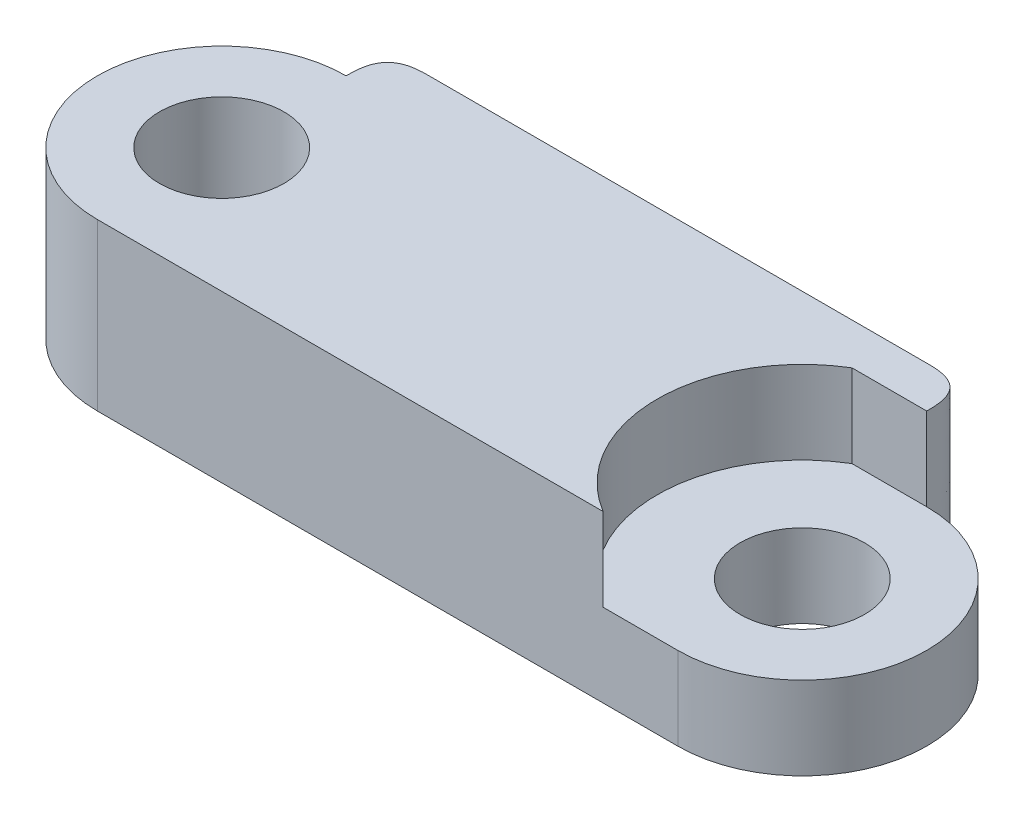
ISO-10303-21;
HEADER;
FILE_DESCRIPTION(('STEP AP214'),'2;1');
FILE_NAME('part.step','',(''),(''),'','','');
FILE_SCHEMA(('AUTOMOTIVE_DESIGN { 1 0 10303 214 1 1 1 1 }'));
ENDSEC;
DATA;
#1=APPLICATION_CONTEXT('core data for automotive mechanical design processes');
#2=APPLICATION_PROTOCOL_DEFINITION('international standard','automotive_design',2000,#1);
#3=PRODUCT_CONTEXT('',#1,'mechanical');
#4=PRODUCT('Part','Part','',(#3));
#5=PRODUCT_RELATED_PRODUCT_CATEGORY('part','',(#4));
#6=PRODUCT_DEFINITION_FORMATION('','',#4);
#7=PRODUCT_DEFINITION_CONTEXT('part definition',#1,'design');
#8=PRODUCT_DEFINITION('design','',#6,#7);
#9=PRODUCT_DEFINITION_SHAPE('','',#8);
#10=(LENGTH_UNIT() NAMED_UNIT(*) SI_UNIT(.MILLI.,.METRE.));
#11=(NAMED_UNIT(*) PLANE_ANGLE_UNIT() SI_UNIT($,.RADIAN.));
#12=(NAMED_UNIT(*) SI_UNIT($,.STERADIAN.) SOLID_ANGLE_UNIT());
#13=UNCERTAINTY_MEASURE_WITH_UNIT(LENGTH_MEASURE(1.E-05),#10,'distance_accuracy_value','');
#14=(GEOMETRIC_REPRESENTATION_CONTEXT(3) GLOBAL_UNCERTAINTY_ASSIGNED_CONTEXT((#13)) GLOBAL_UNIT_ASSIGNED_CONTEXT((#10,
#11,#12)) REPRESENTATION_CONTEXT('',''));
#15=CARTESIAN_POINT('',(0.,0.,0.));
#16=DIRECTION('',(0.,0.,1.));
#17=DIRECTION('',(1.,0.,0.));
#18=AXIS2_PLACEMENT_3D('',#15,#16,#17);
#19=CARTESIAN_POINT('',(-7.,2.,0.));
#20=DIRECTION('',(0.,1.,0.));
#21=DIRECTION('',(0.,0.,1.));
#22=AXIS2_PLACEMENT_3D('',#19,#20,#21);
#23=PLANE('',#22);
#24=DIRECTION('',(-1.,0.,0.));
#25=VECTOR('',#24,1.);
#26=CARTESIAN_POINT('',(-7.,2.,-3.));
#27=LINE('',#26,#25);
#28=CARTESIAN_POINT('',(7.,2.,-3.));
#29=VERTEX_POINT('',#28);
#30=CARTESIAN_POINT('',(5.19722436226801,2.,-3.));
#31=VERTEX_POINT('',#30);
#32=EDGE_CURVE('E210',#29,#31,#27,.T.);
#33=ORIENTED_EDGE('',*,*,#32,.F.);
#34=CARTESIAN_POINT('',(6.,2.,-4.));
#35=CARTESIAN_POINT('',(6.16819805153395,2.,-4.));
#36=CARTESIAN_POINT('',(6.3363961030679,2.,-4.));
#37=CARTESIAN_POINT('',(6.70710678118655,2.,-3.92830808016392));
#38=CARTESIAN_POINT('',(6.92830808016392,2.,-3.70710678118655));
#39=CARTESIAN_POINT('',(7.,2.,-3.33639610306789));
#40=CARTESIAN_POINT('',(7.,2.,-3.16819805153395));
#41=CARTESIAN_POINT('',(7.,2.,-3.));
#42=B_SPLINE_CURVE_WITH_KNOTS('',5,(#34,#35,#36,#37,#38,#39,#40,#41),.UNSPECIFIED.,.F.,.F.,(6,2,
6),(0.,0.5,1.),.UNSPECIFIED.);
#43=CARTESIAN_POINT('',(6.,2.,-4.));
#44=VERTEX_POINT('',#43);
#45=EDGE_CURVE('E11',#29,#44,#42,.F.);
#46=ORIENTED_EDGE('',*,*,#45,.T.);
#47=DIRECTION('',(1.,0.,0.));
#48=VECTOR('',#47,1.);
#49=CARTESIAN_POINT('',(7.,2.,-4.));
#50=LINE('',#49,#48);
#51=CARTESIAN_POINT('',(-6.,2.,-4.));
#52=VERTEX_POINT('',#51);
#53=EDGE_CURVE('E207',#52,#44,#50,.T.);
#54=ORIENTED_EDGE('',*,*,#53,.F.);
#55=CARTESIAN_POINT('',(-7.,2.,-3.));
#56=CARTESIAN_POINT('',(-7.,2.,-3.16819805153395));
#57=CARTESIAN_POINT('',(-7.,2.,-3.33639610306789));
#58=CARTESIAN_POINT('',(-6.92830808016392,2.,-3.70710678118655));
#59=CARTESIAN_POINT('',(-6.70710678118655,2.,-3.92830808016392));
#60=CARTESIAN_POINT('',(-6.3363961030679,2.,-4.));
#61=CARTESIAN_POINT('',(-6.16819805153395,2.,-4.));
#62=CARTESIAN_POINT('',(-6.,2.,-4.));
#63=B_SPLINE_CURVE_WITH_KNOTS('',5,(#55,#56,#57,#58,#59,#60,#61,#62),.UNSPECIFIED.,.F.,.F.,(6,2,
6),(0.,0.5,1.),.UNSPECIFIED.);
#64=CARTESIAN_POINT('',(-7.,2.,-3.));
#65=VERTEX_POINT('',#64);
#66=EDGE_CURVE('E61',#52,#65,#63,.F.);
#67=ORIENTED_EDGE('',*,*,#66,.T.);
#68=CARTESIAN_POINT('',(-7.,2.,0.));
#69=DIRECTION('',(0.,1.,0.));
#70=DIRECTION('',(0.,0.,1.));
#71=AXIS2_PLACEMENT_3D('',#68,#69,#70);
#72=CIRCLE('',#71,3.);
#73=CARTESIAN_POINT('',(-7.,2.,3.));
#74=VERTEX_POINT('',#73);
#75=EDGE_CURVE('E142',#65,#74,#72,.T.);
#76=ORIENTED_EDGE('',*,*,#75,.T.);
#77=DIRECTION('',(1.,0.,0.));
#78=VECTOR('',#77,1.);
#79=CARTESIAN_POINT('',(-7.,2.,3.));
#80=LINE('',#79,#78);
#81=CARTESIAN_POINT('',(5.19722436226801,2.,3.));
#82=VERTEX_POINT('',#81);
#83=EDGE_CURVE('E264',#74,#82,#80,.T.);
#84=ORIENTED_EDGE('',*,*,#83,.T.);
#85=CARTESIAN_POINT('',(7.,2.,0.));
#86=DIRECTION('',(0.,1.,0.));
#87=DIRECTION('',(0.,0.,-1.));
#88=AXIS2_PLACEMENT_3D('',#85,#86,#87);
#89=CIRCLE('',#88,3.5);
#90=EDGE_CURVE('E236',#31,#82,#89,.T.);
#91=ORIENTED_EDGE('',*,*,#90,.F.);
#92=EDGE_LOOP('',(#33,#46,#54,#67,#76,#84,#91));
#93=FACE_BOUND('',#92,.T.);
#94=CARTESIAN_POINT('',(-7.,2.,0.));
#95=DIRECTION('',(0.,1.,0.));
#96=DIRECTION('',(0.,0.,1.));
#97=AXIS2_PLACEMENT_3D('',#94,#95,#96);
#98=CIRCLE('',#97,1.5);
#99=CARTESIAN_POINT('',(-7.,2.,1.5));
#100=VERTEX_POINT('',#99);
#101=EDGE_CURVE('E256',#100,#100,#98,.T.);
#102=ORIENTED_EDGE('',*,*,#101,.F.);
#103=EDGE_LOOP('',(#102));
#104=FACE_BOUND('',#103,.T.);
#105=ADVANCED_FACE('F45',(#93,#104),#23,.T.);
#106=CARTESIAN_POINT('',(-7.,-2.,0.));
#107=DIRECTION('',(0.,1.,0.));
#108=DIRECTION('',(0.,0.,1.));
#109=AXIS2_PLACEMENT_3D('',#106,#107,#108);
#110=PLANE('',#109);
#111=DIRECTION('',(1.,0.,0.));
#112=VECTOR('',#111,1.);
#113=CARTESIAN_POINT('',(7.,-2.,-4.));
#114=LINE('',#113,#112);
#115=CARTESIAN_POINT('',(-6.,-2.,-4.));
#116=VERTEX_POINT('',#115);
#117=CARTESIAN_POINT('',(6.,-2.,-4.));
#118=VERTEX_POINT('',#117);
#119=EDGE_CURVE('E127',#116,#118,#114,.T.);
#120=ORIENTED_EDGE('',*,*,#119,.T.);
#121=CARTESIAN_POINT('',(7.,-2.,-3.));
#122=CARTESIAN_POINT('',(7.,-2.,-3.16819805153395));
#123=CARTESIAN_POINT('',(7.,-2.,-3.33639610306789));
#124=CARTESIAN_POINT('',(6.92830808016392,-2.,-3.70710678118655));
#125=CARTESIAN_POINT('',(6.70710678118655,-2.,-3.92830808016392));
#126=CARTESIAN_POINT('',(6.3363961030679,-2.,-4.));
#127=CARTESIAN_POINT('',(6.16819805153395,-2.,-4.));
#128=CARTESIAN_POINT('',(6.,-2.,-4.));
#129=B_SPLINE_CURVE_WITH_KNOTS('',5,(#121,#122,#123,#124,#125,#126,#127,#128),.UNSPECIFIED.,.F.,
.F.,(6,2,6),(0.,0.5,1.),.UNSPECIFIED.);
#130=CARTESIAN_POINT('',(7.,-2.,-3.));
#131=VERTEX_POINT('',#130);
#132=EDGE_CURVE('E68',#118,#131,#129,.F.);
#133=ORIENTED_EDGE('',*,*,#132,.T.);
#134=CARTESIAN_POINT('',(7.,-2.,0.));
#135=DIRECTION('',(0.,1.,0.));
#136=DIRECTION('',(0.,0.,1.));
#137=AXIS2_PLACEMENT_3D('',#134,#135,#136);
#138=CIRCLE('',#137,3.);
#139=CARTESIAN_POINT('',(7.,-2.,3.));
#140=VERTEX_POINT('',#139);
#141=EDGE_CURVE('E126',#140,#131,#138,.T.);
#142=ORIENTED_EDGE('',*,*,#141,.F.);
#143=DIRECTION('',(1.,0.,0.));
#144=VECTOR('',#143,1.);
#145=CARTESIAN_POINT('',(-7.,-2.,3.));
#146=LINE('',#145,#144);
#147=CARTESIAN_POINT('',(-7.,-2.,3.));
#148=VERTEX_POINT('',#147);
#149=EDGE_CURVE('E143',#148,#140,#146,.T.);
#150=ORIENTED_EDGE('',*,*,#149,.F.);
#151=CARTESIAN_POINT('',(-7.,-2.,0.));
#152=DIRECTION('',(0.,1.,0.));
#153=DIRECTION('',(0.,0.,1.));
#154=AXIS2_PLACEMENT_3D('',#151,#152,#153);
#155=CIRCLE('',#154,3.);
#156=CARTESIAN_POINT('',(-7.,-2.,-3.));
#157=VERTEX_POINT('',#156);
#158=EDGE_CURVE('E260',#157,#148,#155,.T.);
#159=ORIENTED_EDGE('',*,*,#158,.F.);
#160=CARTESIAN_POINT('',(-6.,-2.,-4.));
#161=CARTESIAN_POINT('',(-6.16819805153395,-2.,-4.));
#162=CARTESIAN_POINT('',(-6.3363961030679,-2.,-4.));
#163=CARTESIAN_POINT('',(-6.70710678118655,-2.,-3.92830808016392));
#164=CARTESIAN_POINT('',(-6.92830808016392,-2.,-3.70710678118655));
#165=CARTESIAN_POINT('',(-7.,-2.,-3.33639610306789));
#166=CARTESIAN_POINT('',(-7.,-2.,-3.16819805153395));
#167=CARTESIAN_POINT('',(-7.,-2.,-3.));
#168=B_SPLINE_CURVE_WITH_KNOTS('',5,(#160,#161,#162,#163,#164,#165,#166,#167),.UNSPECIFIED.,.F.,
.F.,(6,2,6),(0.,0.5,1.),.UNSPECIFIED.);
#169=EDGE_CURVE('E77',#157,#116,#168,.F.);
#170=ORIENTED_EDGE('',*,*,#169,.T.);
#171=EDGE_LOOP('',(#120,#133,#142,#150,#159,#170));
#172=FACE_BOUND('',#171,.T.);
#173=CARTESIAN_POINT('',(-7.,-2.,0.));
#174=DIRECTION('',(0.,1.,0.));
#175=DIRECTION('',(0.,0.,1.));
#176=AXIS2_PLACEMENT_3D('',#173,#174,#175);
#177=CIRCLE('',#176,1.5);
#178=CARTESIAN_POINT('',(-7.,-2.,1.5));
#179=VERTEX_POINT('',#178);
#180=EDGE_CURVE('E255',#179,#179,#177,.T.);
#181=ORIENTED_EDGE('',*,*,#180,.T.);
#182=EDGE_LOOP('',(#181));
#183=FACE_BOUND('',#182,.T.);
#184=CARTESIAN_POINT('',(7.,-2.,0.));
#185=DIRECTION('',(0.,1.,0.));
#186=DIRECTION('',(0.,0.,1.));
#187=AXIS2_PLACEMENT_3D('',#184,#185,#186);
#188=CIRCLE('',#187,1.5);
#189=CARTESIAN_POINT('',(7.,-2.,1.5));
#190=VERTEX_POINT('',#189);
#191=EDGE_CURVE('E251',#190,#190,#188,.T.);
#192=ORIENTED_EDGE('',*,*,#191,.T.);
#193=EDGE_LOOP('',(#192));
#194=FACE_BOUND('',#193,.T.);
#195=ADVANCED_FACE('F124',(#172,#183,#194),#110,.F.);
#196=CARTESIAN_POINT('',(-7.,2.,0.));
#197=DIRECTION('',(0.,-1.,0.));
#198=DIRECTION('',(0.,0.,-1.));
#199=AXIS2_PLACEMENT_3D('',#196,#197,#198);
#200=CYLINDRICAL_SURFACE('',#199,3.);
#201=ORIENTED_EDGE('',*,*,#158,.T.);
#202=DIRECTION('',(0.,-1.,0.));
#203=VECTOR('',#202,1.);
#204=CARTESIAN_POINT('',(-7.,2.,3.));
#205=LINE('',#204,#203);
#206=EDGE_CURVE('E271',#74,#148,#205,.T.);
#207=ORIENTED_EDGE('',*,*,#206,.F.);
#208=ORIENTED_EDGE('',*,*,#75,.F.);
#209=CARTESIAN_POINT('',(-7.,-2.2,-3.));
#210=CARTESIAN_POINT('',(-7.,-0.733333333333336,-3.));
#211=CARTESIAN_POINT('',(-7.,0.733333333333336,-3.));
#212=CARTESIAN_POINT('',(-7.,2.2,-3.));
#213=B_SPLINE_CURVE_WITH_KNOTS('',3,(#209,#210,#211,#212),.UNSPECIFIED.,.F.,.F.,(4,4),
(0.0138356688476182,0.0182356688476182),.UNSPECIFIED.);
#214=EDGE_CURVE('E152',#65,#157,#213,.F.);
#215=ORIENTED_EDGE('',*,*,#214,.T.);
#216=EDGE_LOOP('',(#201,#207,#208,#215));
#217=FACE_BOUND('',#216,.T.);
#218=ADVANCED_FACE('F173',(#217),#200,.T.);
#219=CARTESIAN_POINT('',(-7.,2.,3.));
#220=DIRECTION('',(0.,0.,-1.));
#221=DIRECTION('',(-1.,0.,0.));
#222=AXIS2_PLACEMENT_3D('',#219,#220,#221);
#223=PLANE('',#222);
#224=DIRECTION('',(1.,0.,0.));
#225=VECTOR('',#224,1.);
#226=CARTESIAN_POINT('',(7.,0.,3.));
#227=LINE('',#226,#225);
#228=CARTESIAN_POINT('',(5.19722436226801,0.,3.));
#229=VERTEX_POINT('',#228);
#230=CARTESIAN_POINT('',(7.,0.,3.));
#231=VERTEX_POINT('',#230);
#232=EDGE_CURVE('E235',#229,#231,#227,.T.);
#233=ORIENTED_EDGE('',*,*,#232,.F.);
#234=DIRECTION('',(0.,1.,0.));
#235=VECTOR('',#234,1.);
#236=CARTESIAN_POINT('',(5.19722436226801,0.,3.));
#237=LINE('',#236,#235);
#238=EDGE_CURVE('E246',#229,#82,#237,.T.);
#239=ORIENTED_EDGE('',*,*,#238,.T.);
#240=ORIENTED_EDGE('',*,*,#83,.F.);
#241=ORIENTED_EDGE('',*,*,#206,.T.);
#242=ORIENTED_EDGE('',*,*,#149,.T.);
#243=DIRECTION('',(0.,-1.,0.));
#244=VECTOR('',#243,1.);
#245=CARTESIAN_POINT('',(7.,2.,3.));
#246=LINE('',#245,#244);
#247=EDGE_CURVE('E139',#231,#140,#246,.T.);
#248=ORIENTED_EDGE('',*,*,#247,.F.);
#249=EDGE_LOOP('',(#233,#239,#240,#241,#242,#248));
#250=FACE_BOUND('',#249,.T.);
#251=ADVANCED_FACE('F390',(#250),#223,.F.);
#252=CARTESIAN_POINT('',(7.,2.,0.));
#253=DIRECTION('',(0.,-1.,0.));
#254=DIRECTION('',(0.,0.,-1.));
#255=AXIS2_PLACEMENT_3D('',#252,#253,#254);
#256=CYLINDRICAL_SURFACE('',#255,3.);
#257=CARTESIAN_POINT('',(7.,2.2,-3.));
#258=CARTESIAN_POINT('',(7.,0.733333333333334,-3.));
#259=CARTESIAN_POINT('',(7.,-0.73333333333334,-3.));
#260=CARTESIAN_POINT('',(7.,-2.20000000000001,-3.));
#261=B_SPLINE_CURVE_WITH_KNOTS('',3,(#257,#258,#259,#260),.UNSPECIFIED.,.F.,.F.,(4,4),
(0.0138356688476182,0.0182356688476182),.UNSPECIFIED.);
#262=CARTESIAN_POINT('',(7.,0.,-3.));
#263=VERTEX_POINT('',#262);
#264=EDGE_CURVE('E135',#263,#131,#261,.T.);
#265=ORIENTED_EDGE('',*,*,#264,.F.);
#266=CARTESIAN_POINT('',(7.,0.,0.));
#267=DIRECTION('',(0.,1.,0.));
#268=DIRECTION('',(0.,0.,-1.));
#269=AXIS2_PLACEMENT_3D('',#266,#267,#268);
#270=CIRCLE('',#269,3.);
#271=EDGE_CURVE('E239',#231,#263,#270,.T.);
#272=ORIENTED_EDGE('',*,*,#271,.F.);
#273=ORIENTED_EDGE('',*,*,#247,.T.);
#274=ORIENTED_EDGE('',*,*,#141,.T.);
#275=EDGE_LOOP('',(#265,#272,#273,#274));
#276=FACE_BOUND('',#275,.T.);
#277=ADVANCED_FACE('F133',(#276),#256,.T.);
#278=CARTESIAN_POINT('',(-7.,2.,0.));
#279=DIRECTION('',(0.,-1.,0.));
#280=DIRECTION('',(0.,0.,-1.));
#281=AXIS2_PLACEMENT_3D('',#278,#279,#280);
#282=CYLINDRICAL_SURFACE('',#281,1.5);
#283=ORIENTED_EDGE('',*,*,#101,.T.);
#284=EDGE_LOOP('',(#283));
#285=FACE_BOUND('',#284,.T.);
#286=ORIENTED_EDGE('',*,*,#180,.F.);
#287=EDGE_LOOP('',(#286));
#288=FACE_BOUND('',#287,.T.);
#289=ADVANCED_FACE('F389',(#285,#288),#282,.F.);
#290=CARTESIAN_POINT('',(7.,2.,0.));
#291=DIRECTION('',(0.,-1.,0.));
#292=DIRECTION('',(0.,0.,-1.));
#293=AXIS2_PLACEMENT_3D('',#290,#291,#292);
#294=CYLINDRICAL_SURFACE('',#293,1.5);
#295=CARTESIAN_POINT('',(7.,0.,0.));
#296=DIRECTION('',(0.,-1.,0.));
#297=DIRECTION('',(0.,0.,-1.));
#298=AXIS2_PLACEMENT_3D('',#295,#296,#297);
#299=CIRCLE('',#298,1.5);
#300=CARTESIAN_POINT('',(7.,0.,-1.5));
#301=VERTEX_POINT('',#300);
#302=EDGE_CURVE('E225',#301,#301,#299,.T.);
#303=ORIENTED_EDGE('',*,*,#302,.F.);
#304=EDGE_LOOP('',(#303));
#305=FACE_BOUND('',#304,.T.);
#306=ORIENTED_EDGE('',*,*,#191,.F.);
#307=EDGE_LOOP('',(#306));
#308=FACE_BOUND('',#307,.T.);
#309=ADVANCED_FACE('F415',(#305,#308),#294,.F.);
#310=CARTESIAN_POINT('',(7.,0.,0.));
#311=DIRECTION('',(0.,1.,0.));
#312=DIRECTION('',(0.,0.,1.));
#313=AXIS2_PLACEMENT_3D('',#310,#311,#312);
#314=CYLINDRICAL_SURFACE('',#313,3.5);
#315=ORIENTED_EDGE('',*,*,#90,.T.);
#316=ORIENTED_EDGE('',*,*,#238,.F.);
#317=CARTESIAN_POINT('',(7.,0.,0.));
#318=DIRECTION('',(0.,1.,0.));
#319=DIRECTION('',(0.,0.,-1.));
#320=AXIS2_PLACEMENT_3D('',#317,#318,#319);
#321=CIRCLE('',#320,3.5);
#322=CARTESIAN_POINT('',(5.19722436226801,0.,-3.));
#323=VERTEX_POINT('',#322);
#324=EDGE_CURVE('E231',#323,#229,#321,.T.);
#325=ORIENTED_EDGE('',*,*,#324,.F.);
#326=DIRECTION('',(0.,1.,0.));
#327=VECTOR('',#326,1.);
#328=CARTESIAN_POINT('',(5.19722436226801,0.,-3.));
#329=LINE('',#328,#327);
#330=EDGE_CURVE('E242',#323,#31,#329,.T.);
#331=ORIENTED_EDGE('',*,*,#330,.T.);
#332=EDGE_LOOP('',(#315,#316,#325,#331));
#333=FACE_BOUND('',#332,.T.);
#334=ADVANCED_FACE('F418',(#333),#314,.F.);
#335=CARTESIAN_POINT('',(7.,0.,0.));
#336=DIRECTION('',(0.,-1.,0.));
#337=DIRECTION('',(0.,0.,-1.));
#338=AXIS2_PLACEMENT_3D('',#335,#336,#337);
#339=PLANE('',#338);
#340=ORIENTED_EDGE('',*,*,#302,.T.);
#341=EDGE_LOOP('',(#340));
#342=FACE_BOUND('',#341,.T.);
#343=ORIENTED_EDGE('',*,*,#324,.T.);
#344=ORIENTED_EDGE('',*,*,#232,.T.);
#345=ORIENTED_EDGE('',*,*,#271,.T.);
#346=DIRECTION('',(-1.,0.,0.));
#347=VECTOR('',#346,1.);
#348=CARTESIAN_POINT('',(5.19722436226801,0.,-3.));
#349=LINE('',#348,#347);
#350=EDGE_CURVE('E250',#263,#323,#349,.T.);
#351=ORIENTED_EDGE('',*,*,#350,.T.);
#352=EDGE_LOOP('',(#343,#344,#345,#351));
#353=FACE_BOUND('',#352,.T.);
#354=ADVANCED_FACE('F344',(#342,#353),#339,.F.);
#355=CARTESIAN_POINT('',(-7.,16.0356688476182,-3.));
#356=DIRECTION('',(0.,0.,1.));
#357=DIRECTION('',(1.,0.,0.));
#358=AXIS2_PLACEMENT_3D('',#355,#356,#357);
#359=PLANE('',#358);
#360=ORIENTED_EDGE('',*,*,#330,.F.);
#361=ORIENTED_EDGE('',*,*,#350,.F.);
#362=CARTESIAN_POINT('',(7.,2.2,-3.));
#363=CARTESIAN_POINT('',(7.,0.733333333333334,-3.));
#364=CARTESIAN_POINT('',(7.,-0.73333333333334,-3.));
#365=CARTESIAN_POINT('',(7.,-2.20000000000001,-3.));
#366=B_SPLINE_CURVE_WITH_KNOTS('',3,(#362,#363,#364,#365),.UNSPECIFIED.,.F.,.F.,(4,4),
(0.0138356688476182,0.0182356688476182),.UNSPECIFIED.);
#367=EDGE_CURVE('E149',#29,#263,#366,.T.);
#368=ORIENTED_EDGE('',*,*,#367,.F.);
#369=ORIENTED_EDGE('',*,*,#32,.T.);
#370=EDGE_LOOP('',(#360,#361,#368,#369));
#371=FACE_BOUND('',#370,.T.);
#372=ADVANCED_FACE('F335',(#371),#359,.T.);
#373=CARTESIAN_POINT('',(7.,16.0356688476182,-4.));
#374=DIRECTION('',(0.,0.,-1.));
#375=DIRECTION('',(-1.,0.,0.));
#376=AXIS2_PLACEMENT_3D('',#373,#374,#375);
#377=PLANE('',#376);
#378=ORIENTED_EDGE('',*,*,#53,.T.);
#379=CARTESIAN_POINT('',(6.,-2.20000000000001,-4.));
#380=CARTESIAN_POINT('',(6.,-0.73333333333334,-4.));
#381=CARTESIAN_POINT('',(6.,0.733333333333334,-4.));
#382=CARTESIAN_POINT('',(6.,2.2,-4.));
#383=B_SPLINE_CURVE_WITH_KNOTS('',3,(#379,#380,#381,#382),.UNSPECIFIED.,.F.,.F.,(4,4),
(0.0138356688476182,0.0182356688476182),.UNSPECIFIED.);
#384=EDGE_CURVE('E201',#44,#118,#383,.F.);
#385=ORIENTED_EDGE('',*,*,#384,.T.);
#386=ORIENTED_EDGE('',*,*,#119,.F.);
#387=CARTESIAN_POINT('',(-6.,2.2,-4.));
#388=CARTESIAN_POINT('',(-6.,0.733333333333336,-4.));
#389=CARTESIAN_POINT('',(-6.,-0.733333333333336,-4.));
#390=CARTESIAN_POINT('',(-6.,-2.2,-4.));
#391=B_SPLINE_CURVE_WITH_KNOTS('',3,(#387,#388,#389,#390),.UNSPECIFIED.,.F.,.F.,(4,4),
(0.0138356688476182,0.0182356688476182),.UNSPECIFIED.);
#392=EDGE_CURVE('E216',#116,#52,#391,.F.);
#393=ORIENTED_EDGE('',*,*,#392,.T.);
#394=EDGE_LOOP('',(#378,#385,#386,#393));
#395=FACE_BOUND('',#394,.T.);
#396=ADVANCED_FACE('F172',(#395),#377,.T.);
#397=CARTESIAN_POINT('',(6.,2.2,-4.));
#398=CARTESIAN_POINT('',(6.,0.733333333333334,-4.));
#399=CARTESIAN_POINT('',(6.,-0.73333333333334,-4.));
#400=CARTESIAN_POINT('',(6.,-2.20000000000001,-4.));
#401=CARTESIAN_POINT('',(6.16819805153395,2.2,-4.));
#402=CARTESIAN_POINT('',(6.16819805153395,0.733333333333334,-4.));
#403=CARTESIAN_POINT('',(6.16819805153395,-0.73333333333334,-4.));
#404=CARTESIAN_POINT('',(6.16819805153395,-2.20000000000001,-4.));
#405=CARTESIAN_POINT('',(6.3363961030679,2.2,-4.));
#406=CARTESIAN_POINT('',(6.33639610306789,0.733333333333334,-4.));
#407=CARTESIAN_POINT('',(6.33639610306789,-0.73333333333334,-4.));
#408=CARTESIAN_POINT('',(6.3363961030679,-2.20000000000001,-4.));
#409=CARTESIAN_POINT('',(6.70710678118655,2.2,-3.92830808016392));
#410=CARTESIAN_POINT('',(6.70710678118655,0.733333333333334,-3.92830808016392));
#411=CARTESIAN_POINT('',(6.70710678118655,-0.73333333333334,-3.92830808016392));
#412=CARTESIAN_POINT('',(6.70710678118655,-2.20000000000001,-3.92830808016392));
#413=CARTESIAN_POINT('',(6.92830808016392,2.2,-3.70710678118655));
#414=CARTESIAN_POINT('',(6.92830808016392,0.733333333333334,-3.70710678118655));
#415=CARTESIAN_POINT('',(6.92830808016392,-0.73333333333334,-3.70710678118655));
#416=CARTESIAN_POINT('',(6.92830808016392,-2.20000000000001,-3.70710678118655));
#417=CARTESIAN_POINT('',(7.,2.2,-3.33639610306789));
#418=CARTESIAN_POINT('',(7.,0.733333333333334,-3.33639610306789));
#419=CARTESIAN_POINT('',(7.,-0.73333333333334,-3.33639610306789));
#420=CARTESIAN_POINT('',(7.,-2.20000000000001,-3.33639610306789));
#421=CARTESIAN_POINT('',(7.,2.2,-3.16819805153395));
#422=CARTESIAN_POINT('',(7.,0.733333333333334,-3.16819805153394));
#423=CARTESIAN_POINT('',(7.,-0.73333333333334,-3.16819805153394));
#424=CARTESIAN_POINT('',(7.,-2.20000000000001,-3.16819805153395));
#425=CARTESIAN_POINT('',(7.,2.2,-3.));
#426=CARTESIAN_POINT('',(7.,0.733333333333334,-3.));
#427=CARTESIAN_POINT('',(7.,-0.73333333333334,-3.));
#428=CARTESIAN_POINT('',(7.,-2.20000000000001,-3.));
#429=B_SPLINE_SURFACE_WITH_KNOTS('',5,3,((#397,#398,#399,#400),(#401,#402,#403,#404),(#405,#406,
#407,#408),(#409,#410,#411,#412),(#413,#414,#415,#416),(#417,#418,#419,#420),(#421,#422,#423,
#424),(#425,#426,#427,#428)),.UNSPECIFIED.,.F.,.F.,.F.,(6,2,6),(4,4),(0.,0.5,1.),
(0.0138356688476182,0.0182356688476182),.UNSPECIFIED.);
#430=ORIENTED_EDGE('',*,*,#367,.T.);
#431=ORIENTED_EDGE('',*,*,#264,.T.);
#432=ORIENTED_EDGE('',*,*,#132,.F.);
#433=ORIENTED_EDGE('',*,*,#384,.F.);
#434=ORIENTED_EDGE('',*,*,#45,.F.);
#435=EDGE_LOOP('',(#430,#431,#432,#433,#434));
#436=FACE_BOUND('',#435,.T.);
#437=ADVANCED_FACE('F146',(#436),#429,.T.);
#438=CARTESIAN_POINT('',(-7.,2.2,-3.));
#439=CARTESIAN_POINT('',(-7.,0.733333333333336,-3.));
#440=CARTESIAN_POINT('',(-7.,-0.733333333333336,-3.));
#441=CARTESIAN_POINT('',(-7.,-2.2,-3.));
#442=CARTESIAN_POINT('',(-7.,2.2,-3.16819805153395));
#443=CARTESIAN_POINT('',(-7.,0.733333333333336,-3.16819805153395));
#444=CARTESIAN_POINT('',(-7.,-0.733333333333336,-3.16819805153395));
#445=CARTESIAN_POINT('',(-7.,-2.2,-3.16819805153395));
#446=CARTESIAN_POINT('',(-7.,2.2,-3.33639610306789));
#447=CARTESIAN_POINT('',(-7.,0.733333333333336,-3.33639610306789));
#448=CARTESIAN_POINT('',(-7.,-0.733333333333336,-3.33639610306789));
#449=CARTESIAN_POINT('',(-7.,-2.2,-3.33639610306789));
#450=CARTESIAN_POINT('',(-6.92830808016392,2.2,-3.70710678118655));
#451=CARTESIAN_POINT('',(-6.92830808016392,0.733333333333336,-3.70710678118655));
#452=CARTESIAN_POINT('',(-6.92830808016392,-0.733333333333336,-3.70710678118655));
#453=CARTESIAN_POINT('',(-6.92830808016392,-2.2,-3.70710678118655));
#454=CARTESIAN_POINT('',(-6.70710678118655,2.2,-3.92830808016392));
#455=CARTESIAN_POINT('',(-6.70710678118655,0.733333333333336,-3.92830808016392));
#456=CARTESIAN_POINT('',(-6.70710678118655,-0.733333333333336,-3.92830808016392));
#457=CARTESIAN_POINT('',(-6.70710678118655,-2.2,-3.92830808016392));
#458=CARTESIAN_POINT('',(-6.3363961030679,2.2,-4.));
#459=CARTESIAN_POINT('',(-6.33639610306789,0.733333333333336,-4.));
#460=CARTESIAN_POINT('',(-6.33639610306789,-0.733333333333336,-4.));
#461=CARTESIAN_POINT('',(-6.3363961030679,-2.2,-4.));
#462=CARTESIAN_POINT('',(-6.16819805153395,2.2,-4.));
#463=CARTESIAN_POINT('',(-6.16819805153395,0.733333333333336,-4.));
#464=CARTESIAN_POINT('',(-6.16819805153395,-0.733333333333336,-4.));
#465=CARTESIAN_POINT('',(-6.16819805153395,-2.2,-4.));
#466=CARTESIAN_POINT('',(-6.,2.2,-4.));
#467=CARTESIAN_POINT('',(-6.,0.733333333333336,-4.));
#468=CARTESIAN_POINT('',(-6.,-0.733333333333336,-4.));
#469=CARTESIAN_POINT('',(-6.,-2.2,-4.));
#470=B_SPLINE_SURFACE_WITH_KNOTS('',5,3,((#438,#439,#440,#441),(#442,#443,#444,#445),(#446,#447,
#448,#449),(#450,#451,#452,#453),(#454,#455,#456,#457),(#458,#459,#460,#461),(#462,#463,#464,
#465),(#466,#467,#468,#469)),.UNSPECIFIED.,.F.,.F.,.F.,(6,2,6),(4,4),(0.,0.5,1.),
(0.0138356688476182,0.0182356688476182),.UNSPECIFIED.);
#471=ORIENTED_EDGE('',*,*,#66,.F.);
#472=ORIENTED_EDGE('',*,*,#392,.F.);
#473=ORIENTED_EDGE('',*,*,#169,.F.);
#474=ORIENTED_EDGE('',*,*,#214,.F.);
#475=EDGE_LOOP('',(#471,#472,#473,#474));
#476=FACE_BOUND('',#475,.T.);
#477=ADVANCED_FACE('F48',(#476),#470,.T.);
#478=CLOSED_SHELL('',(#105,#195,#218,#251,#277,#289,#309,#334,#354,#372,#396,#437,#477));
#479=MANIFOLD_SOLID_BREP('B2',#478);
#480=ADVANCED_BREP_SHAPE_REPRESENTATION('',(#18,#479),#14);
#481=SHAPE_DEFINITION_REPRESENTATION(#9,#480);
ENDSEC;
END-ISO-10303-21;
